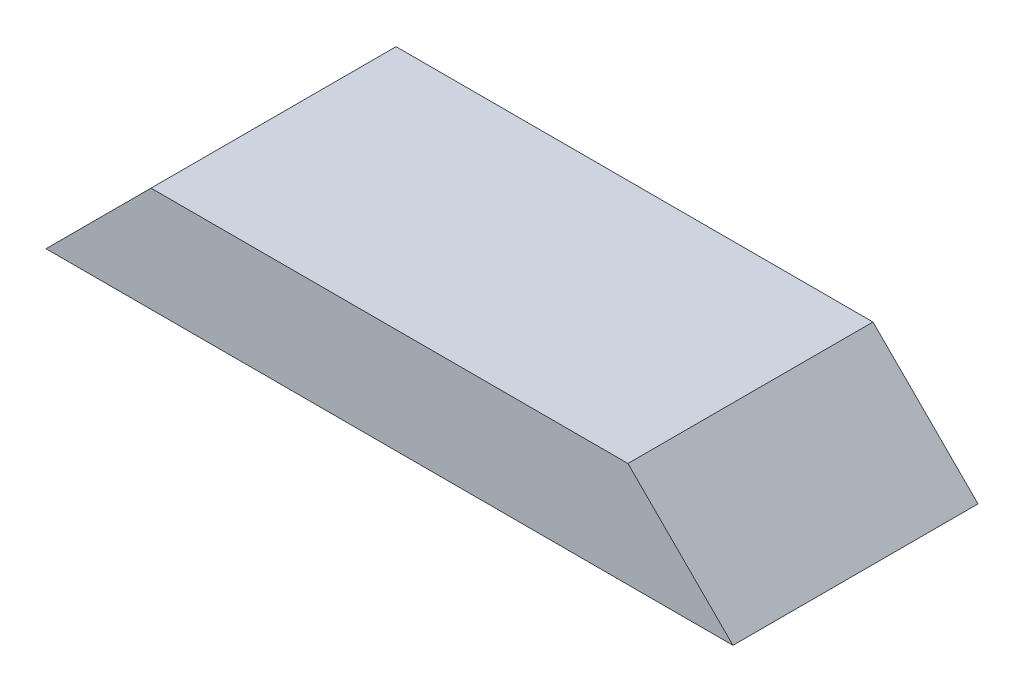
ISO-10303-21;
HEADER;
FILE_DESCRIPTION(('STEP AP214'),'2;1');
FILE_NAME('part.step','',(''),(''),'','','');
FILE_SCHEMA(('AUTOMOTIVE_DESIGN { 1 0 10303 214 1 1 1 1 }'));
ENDSEC;
DATA;
#1=APPLICATION_CONTEXT('core data for automotive mechanical design processes');
#2=APPLICATION_PROTOCOL_DEFINITION('international standard','automotive_design',2000,#1);
#3=PRODUCT_CONTEXT('',#1,'mechanical');
#4=PRODUCT('Part','Part','',(#3));
#5=PRODUCT_RELATED_PRODUCT_CATEGORY('part','',(#4));
#6=PRODUCT_DEFINITION_FORMATION('','',#4);
#7=PRODUCT_DEFINITION_CONTEXT('part definition',#1,'design');
#8=PRODUCT_DEFINITION('design','',#6,#7);
#9=PRODUCT_DEFINITION_SHAPE('','',#8);
#10=(LENGTH_UNIT() NAMED_UNIT(*) SI_UNIT(.MILLI.,.METRE.));
#11=(NAMED_UNIT(*) PLANE_ANGLE_UNIT() SI_UNIT($,.RADIAN.));
#12=(NAMED_UNIT(*) SI_UNIT($,.STERADIAN.) SOLID_ANGLE_UNIT());
#13=UNCERTAINTY_MEASURE_WITH_UNIT(LENGTH_MEASURE(1.E-05),#10,'distance_accuracy_value','');
#14=(GEOMETRIC_REPRESENTATION_CONTEXT(3) GLOBAL_UNCERTAINTY_ASSIGNED_CONTEXT((#13)) GLOBAL_UNIT_ASSIGNED_CONTEXT((#10,
#11,#12)) REPRESENTATION_CONTEXT('',''));
#15=CARTESIAN_POINT('',(0.,0.,0.));
#16=DIRECTION('',(0.,0.,1.));
#17=DIRECTION('',(1.,0.,0.));
#18=AXIS2_PLACEMENT_3D('',#15,#16,#17);
#19=CARTESIAN_POINT('',(0.,38.1,0.));
#20=DIRECTION('',(0.,0.,-1.));
#21=DIRECTION('',(-1.,0.,0.));
#22=AXIS2_PLACEMENT_3D('',#19,#20,#21);
#23=PLANE('',#22);
#24=DIRECTION('',(1.,0.,0.));
#25=VECTOR('',#24,1.);
#26=CARTESIAN_POINT('',(0.,38.1,0.));
#27=LINE('',#26,#25);
#28=CARTESIAN_POINT('',(38.1,38.1,0.));
#29=VERTEX_POINT('',#28);
#30=CARTESIAN_POINT('',(211.1375,38.1,0.));
#31=VERTEX_POINT('',#30);
#32=EDGE_CURVE('E47',#29,#31,#27,.T.);
#33=ORIENTED_EDGE('',*,*,#32,.F.);
#34=DIRECTION('',(0.707106781186547,0.707106781186547,0.));
#35=VECTOR('',#34,1.);
#36=CARTESIAN_POINT('',(0.,0.,0.));
#37=LINE('',#36,#35);
#38=CARTESIAN_POINT('',(0.,0.,0.));
#39=VERTEX_POINT('',#38);
#40=EDGE_CURVE('E82',#39,#29,#37,.T.);
#41=ORIENTED_EDGE('',*,*,#40,.F.);
#42=DIRECTION('',(1.,0.,0.));
#43=VECTOR('',#42,1.);
#44=CARTESIAN_POINT('',(0.,0.,0.));
#45=LINE('',#44,#43);
#46=CARTESIAN_POINT('',(249.2375,0.,0.));
#47=VERTEX_POINT('',#46);
#48=EDGE_CURVE('E87',#39,#47,#45,.T.);
#49=ORIENTED_EDGE('',*,*,#48,.T.);
#50=DIRECTION('',(0.707106781186547,-0.707106781186548,0.));
#51=VECTOR('',#50,1.);
#52=CARTESIAN_POINT('',(249.2375,0.,0.));
#53=LINE('',#52,#51);
#54=EDGE_CURVE('E63',#31,#47,#53,.T.);
#55=ORIENTED_EDGE('',*,*,#54,.F.);
#56=EDGE_LOOP('',(#33,#41,#49,#55));
#57=FACE_BOUND('',#56,.T.);
#58=ADVANCED_FACE('F39',(#57),#23,.F.);
#59=CARTESIAN_POINT('',(0.,38.1,-88.9));
#60=DIRECTION('',(0.,0.,1.));
#61=DIRECTION('',(1.,0.,0.));
#62=AXIS2_PLACEMENT_3D('',#59,#60,#61);
#63=PLANE('',#62);
#64=DIRECTION('',(-1.,0.,0.));
#65=VECTOR('',#64,1.);
#66=CARTESIAN_POINT('',(0.,0.,-88.9));
#67=LINE('',#66,#65);
#68=CARTESIAN_POINT('',(249.2375,0.,-88.9));
#69=VERTEX_POINT('',#68);
#70=CARTESIAN_POINT('',(0.,0.,-88.9));
#71=VERTEX_POINT('',#70);
#72=EDGE_CURVE('E42',#69,#71,#67,.T.);
#73=ORIENTED_EDGE('',*,*,#72,.T.);
#74=DIRECTION('',(0.707106781186547,0.707106781186547,0.));
#75=VECTOR('',#74,1.);
#76=CARTESIAN_POINT('',(0.,0.,-88.9));
#77=LINE('',#76,#75);
#78=CARTESIAN_POINT('',(38.1,38.1,-88.9));
#79=VERTEX_POINT('',#78);
#80=EDGE_CURVE('E55',#71,#79,#77,.T.);
#81=ORIENTED_EDGE('',*,*,#80,.T.);
#82=DIRECTION('',(-1.,0.,0.));
#83=VECTOR('',#82,1.);
#84=CARTESIAN_POINT('',(0.,38.1,-88.9));
#85=LINE('',#84,#83);
#86=CARTESIAN_POINT('',(211.1375,38.1,-88.9));
#87=VERTEX_POINT('',#86);
#88=EDGE_CURVE('E11',#87,#79,#85,.T.);
#89=ORIENTED_EDGE('',*,*,#88,.F.);
#90=DIRECTION('',(0.707106781186547,-0.707106781186548,0.));
#91=VECTOR('',#90,1.);
#92=CARTESIAN_POINT('',(249.2375,0.,-88.9));
#93=LINE('',#92,#91);
#94=EDGE_CURVE('E100',#87,#69,#93,.T.);
#95=ORIENTED_EDGE('',*,*,#94,.T.);
#96=EDGE_LOOP('',(#73,#81,#89,#95));
#97=FACE_BOUND('',#96,.T.);
#98=ADVANCED_FACE('F109',(#97),#63,.F.);
#99=CARTESIAN_POINT('',(0.,38.1,0.));
#100=DIRECTION('',(0.,-1.,0.));
#101=DIRECTION('',(0.,0.,-1.));
#102=AXIS2_PLACEMENT_3D('',#99,#100,#101);
#103=PLANE('',#102);
#104=ORIENTED_EDGE('',*,*,#88,.T.);
#105=DIRECTION('',(0.,0.,1.));
#106=VECTOR('',#105,1.);
#107=CARTESIAN_POINT('',(38.1,38.1,-88.9));
#108=LINE('',#107,#106);
#109=EDGE_CURVE('E88',#79,#29,#108,.T.);
#110=ORIENTED_EDGE('',*,*,#109,.T.);
#111=ORIENTED_EDGE('',*,*,#32,.T.);
#112=DIRECTION('',(0.,0.,1.));
#113=VECTOR('',#112,1.);
#114=CARTESIAN_POINT('',(211.1375,38.1,-88.9));
#115=LINE('',#114,#113);
#116=EDGE_CURVE('E103',#87,#31,#115,.T.);
#117=ORIENTED_EDGE('',*,*,#116,.F.);
#118=EDGE_LOOP('',(#104,#110,#111,#117));
#119=FACE_BOUND('',#118,.T.);
#120=ADVANCED_FACE('F112',(#119),#103,.F.);
#121=CARTESIAN_POINT('',(0.,0.,0.));
#122=DIRECTION('',(0.,-1.,0.));
#123=DIRECTION('',(0.,0.,-1.));
#124=AXIS2_PLACEMENT_3D('',#121,#122,#123);
#125=PLANE('',#124);
#126=DIRECTION('',(0.,0.,1.));
#127=VECTOR('',#126,1.);
#128=CARTESIAN_POINT('',(0.,0.,0.));
#129=LINE('',#128,#127);
#130=EDGE_CURVE('E79',#71,#39,#129,.T.);
#131=ORIENTED_EDGE('',*,*,#130,.F.);
#132=ORIENTED_EDGE('',*,*,#72,.F.);
#133=DIRECTION('',(0.,0.,-1.));
#134=VECTOR('',#133,1.);
#135=CARTESIAN_POINT('',(249.2375,0.,0.));
#136=LINE('',#135,#134);
#137=EDGE_CURVE('E96',#47,#69,#136,.T.);
#138=ORIENTED_EDGE('',*,*,#137,.F.);
#139=ORIENTED_EDGE('',*,*,#48,.F.);
#140=EDGE_LOOP('',(#131,#132,#138,#139));
#141=FACE_BOUND('',#140,.T.);
#142=ADVANCED_FACE('F95',(#141),#125,.T.);
#143=CARTESIAN_POINT('',(249.2375,0.,-88.9));
#144=DIRECTION('',(-0.707106781186548,-0.707106781186547,0.));
#145=DIRECTION('',(0.707106781186547,-0.707106781186548,0.));
#146=AXIS2_PLACEMENT_3D('',#143,#144,#145);
#147=PLANE('',#146);
#148=ORIENTED_EDGE('',*,*,#54,.T.);
#149=ORIENTED_EDGE('',*,*,#137,.T.);
#150=ORIENTED_EDGE('',*,*,#94,.F.);
#151=ORIENTED_EDGE('',*,*,#116,.T.);
#152=EDGE_LOOP('',(#148,#149,#150,#151));
#153=FACE_BOUND('',#152,.T.);
#154=ADVANCED_FACE('F113',(#153),#147,.F.);
#155=CARTESIAN_POINT('',(0.,0.,-88.9));
#156=DIRECTION('',(0.707106781186547,-0.707106781186547,0.));
#157=DIRECTION('',(0.707106781186548,0.707106781186548,0.));
#158=AXIS2_PLACEMENT_3D('',#155,#156,#157);
#159=PLANE('',#158);
#160=ORIENTED_EDGE('',*,*,#40,.T.);
#161=ORIENTED_EDGE('',*,*,#109,.F.);
#162=ORIENTED_EDGE('',*,*,#80,.F.);
#163=ORIENTED_EDGE('',*,*,#130,.T.);
#164=EDGE_LOOP('',(#160,#161,#162,#163));
#165=FACE_BOUND('',#164,.T.);
#166=ADVANCED_FACE('F81',(#165),#159,.F.);
#167=CLOSED_SHELL('',(#58,#98,#120,#142,#154,#166));
#168=MANIFOLD_SOLID_BREP('B2',#167);
#169=ADVANCED_BREP_SHAPE_REPRESENTATION('',(#18,#168),#14);
#170=SHAPE_DEFINITION_REPRESENTATION(#9,#169);
ENDSEC;
END-ISO-10303-21;
